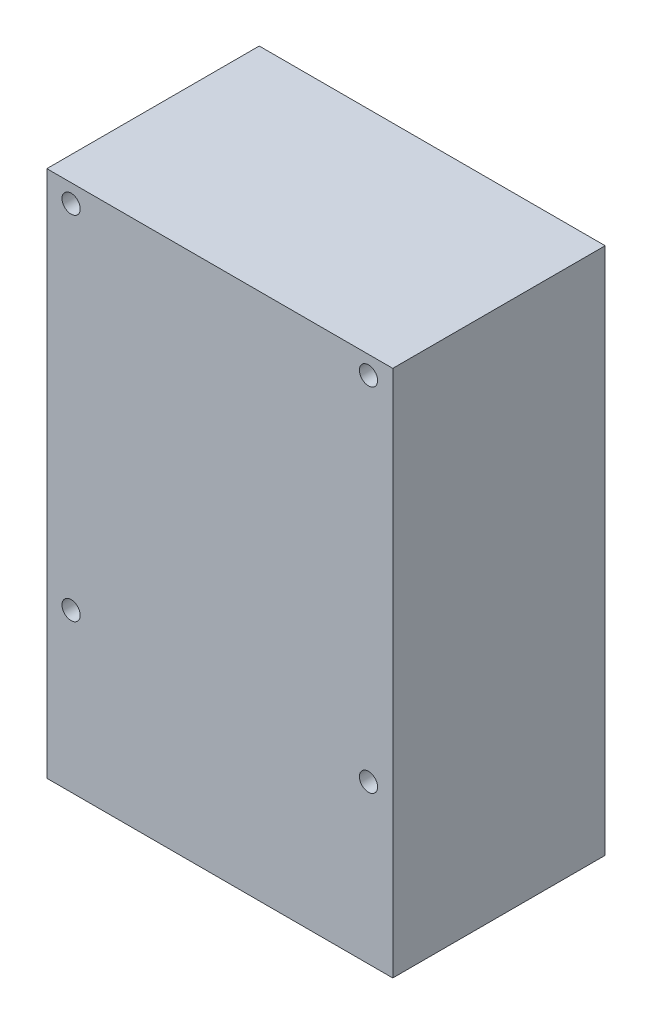
ISO-10303-21;
HEADER;
FILE_DESCRIPTION(('STEP AP214'),'2;1');
FILE_NAME('part.step','',(''),(''),'','','');
FILE_SCHEMA(('AUTOMOTIVE_DESIGN { 1 0 10303 214 1 1 1 1 }'));
ENDSEC;
DATA;
#1=APPLICATION_CONTEXT('core data for automotive mechanical design processes');
#2=APPLICATION_PROTOCOL_DEFINITION('international standard','automotive_design',2000,#1);
#3=PRODUCT_CONTEXT('',#1,'mechanical');
#4=PRODUCT('Part','Part','',(#3));
#5=PRODUCT_RELATED_PRODUCT_CATEGORY('part','',(#4));
#6=PRODUCT_DEFINITION_FORMATION('','',#4);
#7=PRODUCT_DEFINITION_CONTEXT('part definition',#1,'design');
#8=PRODUCT_DEFINITION('design','',#6,#7);
#9=PRODUCT_DEFINITION_SHAPE('','',#8);
#10=(LENGTH_UNIT() NAMED_UNIT(*) SI_UNIT(.MILLI.,.METRE.));
#11=(NAMED_UNIT(*) PLANE_ANGLE_UNIT() SI_UNIT($,.RADIAN.));
#12=(NAMED_UNIT(*) SI_UNIT($,.STERADIAN.) SOLID_ANGLE_UNIT());
#13=UNCERTAINTY_MEASURE_WITH_UNIT(LENGTH_MEASURE(1.E-05),#10,'distance_accuracy_value','');
#14=(GEOMETRIC_REPRESENTATION_CONTEXT(3) GLOBAL_UNCERTAINTY_ASSIGNED_CONTEXT((#13)) GLOBAL_UNIT_ASSIGNED_CONTEXT((#10,
#11,#12)) REPRESENTATION_CONTEXT('',''));
#15=CARTESIAN_POINT('',(0.,0.,0.));
#16=DIRECTION('',(0.,0.,1.));
#17=DIRECTION('',(1.,0.,0.));
#18=AXIS2_PLACEMENT_3D('',#15,#16,#17);
#19=CARTESIAN_POINT('',(-28.5,43.5,35.));
#20=DIRECTION('',(1.,0.,0.));
#21=DIRECTION('',(0.,1.,0.));
#22=AXIS2_PLACEMENT_3D('',#19,#20,#21);
#23=PLANE('',#22);
#24=DIRECTION('',(0.,-1.,0.));
#25=VECTOR('',#24,1.);
#26=CARTESIAN_POINT('',(-28.5,43.5,0.));
#27=LINE('',#26,#25);
#28=CARTESIAN_POINT('',(-28.5,43.5,0.));
#29=VERTEX_POINT('',#28);
#30=CARTESIAN_POINT('',(-28.5,-43.5,0.));
#31=VERTEX_POINT('',#30);
#32=EDGE_CURVE('E96',#29,#31,#27,.T.);
#33=ORIENTED_EDGE('',*,*,#32,.T.);
#34=DIRECTION('',(0.,0.,-1.));
#35=VECTOR('',#34,1.);
#36=CARTESIAN_POINT('',(-28.5,-43.5,35.));
#37=LINE('',#36,#35);
#38=CARTESIAN_POINT('',(-28.5,-43.5,35.));
#39=VERTEX_POINT('',#38);
#40=EDGE_CURVE('E11',#39,#31,#37,.T.);
#41=ORIENTED_EDGE('',*,*,#40,.F.);
#42=DIRECTION('',(0.,-1.,0.));
#43=VECTOR('',#42,1.);
#44=CARTESIAN_POINT('',(-28.5,43.5,35.));
#45=LINE('',#44,#43);
#46=CARTESIAN_POINT('',(-28.5,43.5,35.));
#47=VERTEX_POINT('',#46);
#48=EDGE_CURVE('E84',#47,#39,#45,.T.);
#49=ORIENTED_EDGE('',*,*,#48,.F.);
#50=DIRECTION('',(0.,0.,-1.));
#51=VECTOR('',#50,1.);
#52=CARTESIAN_POINT('',(-28.5,43.5,35.));
#53=LINE('',#52,#51);
#54=EDGE_CURVE('E92',#47,#29,#53,.T.);
#55=ORIENTED_EDGE('',*,*,#54,.T.);
#56=EDGE_LOOP('',(#33,#41,#49,#55));
#57=FACE_BOUND('',#56,.T.);
#58=ADVANCED_FACE('F33',(#57),#23,.F.);
#59=CARTESIAN_POINT('',(28.5,-43.5,35.));
#60=DIRECTION('',(0.,1.,0.));
#61=DIRECTION('',(-1.,0.,0.));
#62=AXIS2_PLACEMENT_3D('',#59,#60,#61);
#63=PLANE('',#62);
#64=DIRECTION('',(1.,0.,0.));
#65=VECTOR('',#64,1.);
#66=CARTESIAN_POINT('',(28.5,-43.5,0.));
#67=LINE('',#66,#65);
#68=CARTESIAN_POINT('',(28.5,-43.5,0.));
#69=VERTEX_POINT('',#68);
#70=EDGE_CURVE('E88',#31,#69,#67,.T.);
#71=ORIENTED_EDGE('',*,*,#70,.T.);
#72=DIRECTION('',(0.,0.,-1.));
#73=VECTOR('',#72,1.);
#74=CARTESIAN_POINT('',(28.5,-43.5,35.));
#75=LINE('',#74,#73);
#76=CARTESIAN_POINT('',(28.5,-43.5,35.));
#77=VERTEX_POINT('',#76);
#78=EDGE_CURVE('E41',#77,#69,#75,.T.);
#79=ORIENTED_EDGE('',*,*,#78,.F.);
#80=DIRECTION('',(1.,0.,0.));
#81=VECTOR('',#80,1.);
#82=CARTESIAN_POINT('',(28.5,-43.5,35.));
#83=LINE('',#82,#81);
#84=EDGE_CURVE('E79',#39,#77,#83,.T.);
#85=ORIENTED_EDGE('',*,*,#84,.F.);
#86=ORIENTED_EDGE('',*,*,#40,.T.);
#87=EDGE_LOOP('',(#71,#79,#85,#86));
#88=FACE_BOUND('',#87,.T.);
#89=ADVANCED_FACE('F87',(#88),#63,.F.);
#90=CARTESIAN_POINT('',(28.5,43.5,35.));
#91=DIRECTION('',(-1.,0.,0.));
#92=DIRECTION('',(0.,-1.,0.));
#93=AXIS2_PLACEMENT_3D('',#90,#91,#92);
#94=PLANE('',#93);
#95=DIRECTION('',(0.,1.,0.));
#96=VECTOR('',#95,1.);
#97=CARTESIAN_POINT('',(28.5,43.5,0.));
#98=LINE('',#97,#96);
#99=CARTESIAN_POINT('',(28.5,43.5,0.));
#100=VERTEX_POINT('',#99);
#101=EDGE_CURVE('E66',#69,#100,#98,.T.);
#102=ORIENTED_EDGE('',*,*,#101,.T.);
#103=DIRECTION('',(0.,0.,-1.));
#104=VECTOR('',#103,1.);
#105=CARTESIAN_POINT('',(28.5,43.5,35.));
#106=LINE('',#105,#104);
#107=CARTESIAN_POINT('',(28.5,43.5,35.));
#108=VERTEX_POINT('',#107);
#109=EDGE_CURVE('E89',#108,#100,#106,.T.);
#110=ORIENTED_EDGE('',*,*,#109,.F.);
#111=DIRECTION('',(0.,1.,0.));
#112=VECTOR('',#111,1.);
#113=CARTESIAN_POINT('',(28.5,43.5,35.));
#114=LINE('',#113,#112);
#115=EDGE_CURVE('E82',#77,#108,#114,.T.);
#116=ORIENTED_EDGE('',*,*,#115,.F.);
#117=ORIENTED_EDGE('',*,*,#78,.T.);
#118=EDGE_LOOP('',(#102,#110,#116,#117));
#119=FACE_BOUND('',#118,.T.);
#120=ADVANCED_FACE('F90',(#119),#94,.F.);
#121=CARTESIAN_POINT('',(28.5,43.5,35.));
#122=DIRECTION('',(0.,-1.,0.));
#123=DIRECTION('',(0.,0.,-1.));
#124=AXIS2_PLACEMENT_3D('',#121,#122,#123);
#125=PLANE('',#124);
#126=DIRECTION('',(-1.,0.,0.));
#127=VECTOR('',#126,1.);
#128=CARTESIAN_POINT('',(28.5,43.5,0.));
#129=LINE('',#128,#127);
#130=EDGE_CURVE('E72',#100,#29,#129,.T.);
#131=ORIENTED_EDGE('',*,*,#130,.T.);
#132=ORIENTED_EDGE('',*,*,#54,.F.);
#133=DIRECTION('',(-1.,0.,0.));
#134=VECTOR('',#133,1.);
#135=CARTESIAN_POINT('',(28.5,43.5,35.));
#136=LINE('',#135,#134);
#137=EDGE_CURVE('E49',#108,#47,#136,.T.);
#138=ORIENTED_EDGE('',*,*,#137,.F.);
#139=ORIENTED_EDGE('',*,*,#109,.T.);
#140=EDGE_LOOP('',(#131,#132,#138,#139));
#141=FACE_BOUND('',#140,.T.);
#142=ADVANCED_FACE('F104',(#141),#125,.F.);
#143=CARTESIAN_POINT('',(0.,0.,35.));
#144=DIRECTION('',(0.,0.,-1.));
#145=DIRECTION('',(-1.,0.,0.));
#146=AXIS2_PLACEMENT_3D('',#143,#144,#145);
#147=PLANE('',#146);
#148=CARTESIAN_POINT('',(-24.5,40.5,35.));
#149=DIRECTION('',(0.,0.,-1.));
#150=DIRECTION('',(-1.,0.,0.));
#151=AXIS2_PLACEMENT_3D('',#148,#149,#150);
#152=CIRCLE('',#151,1.5);
#153=CARTESIAN_POINT('',(-26.,40.5,35.));
#154=VERTEX_POINT('',#153);
#155=EDGE_CURVE('E113',#154,#154,#152,.T.);
#156=ORIENTED_EDGE('',*,*,#155,.T.);
#157=EDGE_LOOP('',(#156));
#158=FACE_BOUND('',#157,.T.);
#159=CARTESIAN_POINT('',(24.5,-17.5,35.));
#160=DIRECTION('',(0.,0.,-1.));
#161=DIRECTION('',(-1.,0.,0.));
#162=AXIS2_PLACEMENT_3D('',#159,#160,#161);
#163=CIRCLE('',#162,1.5);
#164=CARTESIAN_POINT('',(23.,-17.5,35.));
#165=VERTEX_POINT('',#164);
#166=EDGE_CURVE('E125',#165,#165,#163,.T.);
#167=ORIENTED_EDGE('',*,*,#166,.T.);
#168=EDGE_LOOP('',(#167));
#169=FACE_BOUND('',#168,.T.);
#170=CARTESIAN_POINT('',(-24.5,-17.5,35.));
#171=DIRECTION('',(0.,0.,-1.));
#172=DIRECTION('',(-1.,0.,0.));
#173=AXIS2_PLACEMENT_3D('',#170,#171,#172);
#174=CIRCLE('',#173,1.5);
#175=CARTESIAN_POINT('',(-26.,-17.5,35.));
#176=VERTEX_POINT('',#175);
#177=EDGE_CURVE('E119',#176,#176,#174,.T.);
#178=ORIENTED_EDGE('',*,*,#177,.T.);
#179=EDGE_LOOP('',(#178));
#180=FACE_BOUND('',#179,.T.);
#181=CARTESIAN_POINT('',(24.5,40.5,35.));
#182=DIRECTION('',(0.,0.,-1.));
#183=DIRECTION('',(-1.,0.,0.));
#184=AXIS2_PLACEMENT_3D('',#181,#182,#183);
#185=CIRCLE('',#184,1.5);
#186=CARTESIAN_POINT('',(23.,40.5,35.));
#187=VERTEX_POINT('',#186);
#188=EDGE_CURVE('E99',#187,#187,#185,.T.);
#189=ORIENTED_EDGE('',*,*,#188,.T.);
#190=EDGE_LOOP('',(#189));
#191=FACE_BOUND('',#190,.T.);
#192=ORIENTED_EDGE('',*,*,#48,.T.);
#193=ORIENTED_EDGE('',*,*,#84,.T.);
#194=ORIENTED_EDGE('',*,*,#115,.T.);
#195=ORIENTED_EDGE('',*,*,#137,.T.);
#196=EDGE_LOOP('',(#192,#193,#194,#195));
#197=FACE_BOUND('',#196,.T.);
#198=ADVANCED_FACE('F80',(#158,#169,#180,#191,#197),#147,.F.);
#199=CARTESIAN_POINT('',(0.,0.,0.));
#200=DIRECTION('',(0.,0.,-1.));
#201=DIRECTION('',(-1.,0.,0.));
#202=AXIS2_PLACEMENT_3D('',#199,#200,#201);
#203=PLANE('',#202);
#204=CARTESIAN_POINT('',(-24.5,40.5,0.));
#205=DIRECTION('',(0.,0.,-1.));
#206=DIRECTION('',(-1.,0.,0.));
#207=AXIS2_PLACEMENT_3D('',#204,#205,#206);
#208=CIRCLE('',#207,1.5);
#209=CARTESIAN_POINT('',(-26.,40.5,0.));
#210=VERTEX_POINT('',#209);
#211=EDGE_CURVE('E128',#210,#210,#208,.T.);
#212=ORIENTED_EDGE('',*,*,#211,.F.);
#213=EDGE_LOOP('',(#212));
#214=FACE_BOUND('',#213,.T.);
#215=CARTESIAN_POINT('',(24.5,-17.5,0.));
#216=DIRECTION('',(0.,0.,-1.));
#217=DIRECTION('',(-1.,0.,0.));
#218=AXIS2_PLACEMENT_3D('',#215,#216,#217);
#219=CIRCLE('',#218,1.5);
#220=CARTESIAN_POINT('',(23.,-17.5,0.));
#221=VERTEX_POINT('',#220);
#222=EDGE_CURVE('E122',#221,#221,#219,.T.);
#223=ORIENTED_EDGE('',*,*,#222,.F.);
#224=EDGE_LOOP('',(#223));
#225=FACE_BOUND('',#224,.T.);
#226=CARTESIAN_POINT('',(-24.5,-17.5,0.));
#227=DIRECTION('',(0.,0.,-1.));
#228=DIRECTION('',(-1.,0.,0.));
#229=AXIS2_PLACEMENT_3D('',#226,#227,#228);
#230=CIRCLE('',#229,1.5);
#231=CARTESIAN_POINT('',(-26.,-17.5,0.));
#232=VERTEX_POINT('',#231);
#233=EDGE_CURVE('E116',#232,#232,#230,.T.);
#234=ORIENTED_EDGE('',*,*,#233,.F.);
#235=EDGE_LOOP('',(#234));
#236=FACE_BOUND('',#235,.T.);
#237=CARTESIAN_POINT('',(24.5,40.5,0.));
#238=DIRECTION('',(0.,0.,-1.));
#239=DIRECTION('',(-1.,0.,0.));
#240=AXIS2_PLACEMENT_3D('',#237,#238,#239);
#241=CIRCLE('',#240,1.5);
#242=CARTESIAN_POINT('',(23.,40.5,0.));
#243=VERTEX_POINT('',#242);
#244=EDGE_CURVE('E110',#243,#243,#241,.T.);
#245=ORIENTED_EDGE('',*,*,#244,.F.);
#246=EDGE_LOOP('',(#245));
#247=FACE_BOUND('',#246,.T.);
#248=ORIENTED_EDGE('',*,*,#32,.F.);
#249=ORIENTED_EDGE('',*,*,#130,.F.);
#250=ORIENTED_EDGE('',*,*,#101,.F.);
#251=ORIENTED_EDGE('',*,*,#70,.F.);
#252=EDGE_LOOP('',(#248,#249,#250,#251));
#253=FACE_BOUND('',#252,.T.);
#254=ADVANCED_FACE('F107',(#214,#225,#236,#247,#253),#203,.T.);
#255=CARTESIAN_POINT('',(24.5,40.5,35.));
#256=DIRECTION('',(0.,0.,-1.));
#257=DIRECTION('',(-1.,0.,0.));
#258=AXIS2_PLACEMENT_3D('',#255,#256,#257);
#259=CYLINDRICAL_SURFACE('',#258,1.5);
#260=ORIENTED_EDGE('',*,*,#188,.F.);
#261=EDGE_LOOP('',(#260));
#262=FACE_BOUND('',#261,.T.);
#263=ORIENTED_EDGE('',*,*,#244,.T.);
#264=EDGE_LOOP('',(#263));
#265=FACE_BOUND('',#264,.T.);
#266=ADVANCED_FACE('F145',(#262,#265),#259,.F.);
#267=CARTESIAN_POINT('',(-24.5,-17.5,35.));
#268=DIRECTION('',(0.,0.,-1.));
#269=DIRECTION('',(-1.,0.,0.));
#270=AXIS2_PLACEMENT_3D('',#267,#268,#269);
#271=CYLINDRICAL_SURFACE('',#270,1.5);
#272=ORIENTED_EDGE('',*,*,#177,.F.);
#273=EDGE_LOOP('',(#272));
#274=FACE_BOUND('',#273,.T.);
#275=ORIENTED_EDGE('',*,*,#233,.T.);
#276=EDGE_LOOP('',(#275));
#277=FACE_BOUND('',#276,.T.);
#278=ADVANCED_FACE('F154',(#274,#277),#271,.F.);
#279=CARTESIAN_POINT('',(24.5,-17.5,35.));
#280=DIRECTION('',(0.,0.,-1.));
#281=DIRECTION('',(-1.,0.,0.));
#282=AXIS2_PLACEMENT_3D('',#279,#280,#281);
#283=CYLINDRICAL_SURFACE('',#282,1.5);
#284=ORIENTED_EDGE('',*,*,#166,.F.);
#285=EDGE_LOOP('',(#284));
#286=FACE_BOUND('',#285,.T.);
#287=ORIENTED_EDGE('',*,*,#222,.T.);
#288=EDGE_LOOP('',(#287));
#289=FACE_BOUND('',#288,.T.);
#290=ADVANCED_FACE('F139',(#286,#289),#283,.F.);
#291=CARTESIAN_POINT('',(-24.5,40.5,35.));
#292=DIRECTION('',(0.,0.,-1.));
#293=DIRECTION('',(-1.,0.,0.));
#294=AXIS2_PLACEMENT_3D('',#291,#292,#293);
#295=CYLINDRICAL_SURFACE('',#294,1.5);
#296=ORIENTED_EDGE('',*,*,#155,.F.);
#297=EDGE_LOOP('',(#296));
#298=FACE_BOUND('',#297,.T.);
#299=ORIENTED_EDGE('',*,*,#211,.T.);
#300=EDGE_LOOP('',(#299));
#301=FACE_BOUND('',#300,.T.);
#302=ADVANCED_FACE('F136',(#298,#301),#295,.F.);
#303=CLOSED_SHELL('',(#58,#89,#120,#142,#198,#254,#266,#278,#290,#302));
#304=MANIFOLD_SOLID_BREP('B2',#303);
#305=ADVANCED_BREP_SHAPE_REPRESENTATION('',(#18,#304),#14);
#306=SHAPE_DEFINITION_REPRESENTATION(#9,#305);
ENDSEC;
END-ISO-10303-21;
